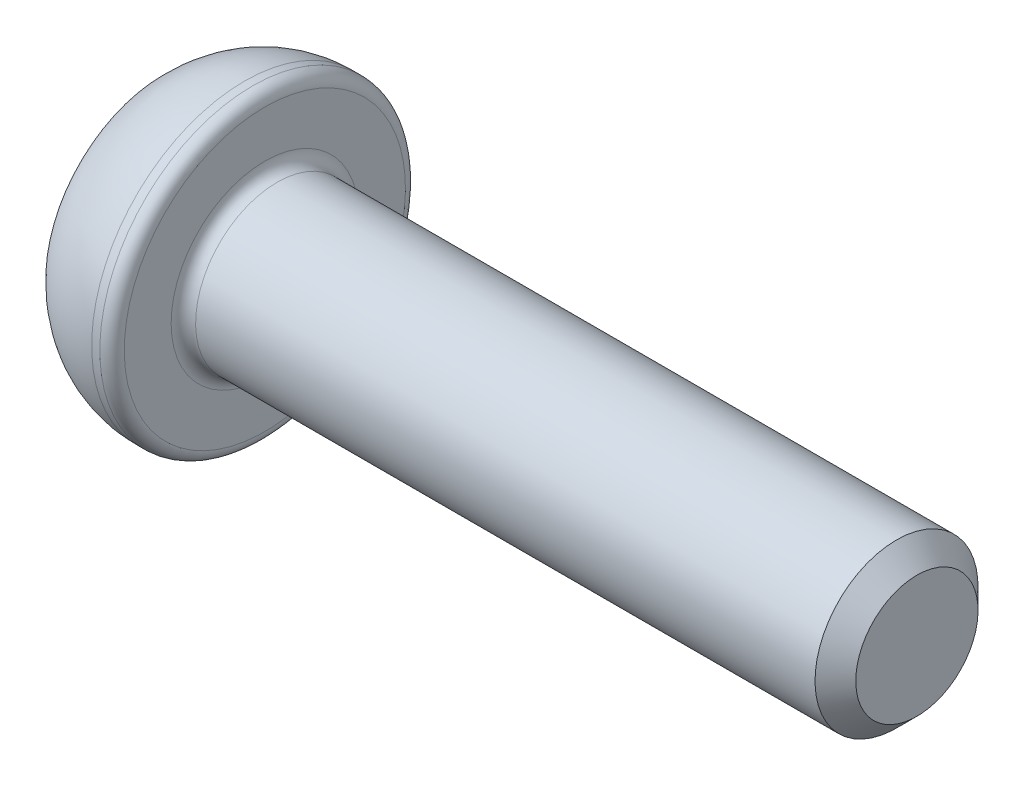
ISO-10303-21;
HEADER;
FILE_DESCRIPTION(('STEP AP214'),'2;1');
FILE_NAME('part.step','',(''),(''),'','','');
FILE_SCHEMA(('AUTOMOTIVE_DESIGN { 1 0 10303 214 1 1 1 1 }'));
ENDSEC;
DATA;
#1=APPLICATION_CONTEXT('core data for automotive mechanical design processes');
#2=APPLICATION_PROTOCOL_DEFINITION('international standard','automotive_design',2000,#1);
#3=PRODUCT_CONTEXT('',#1,'mechanical');
#4=PRODUCT('Part','Part','',(#3));
#5=PRODUCT_RELATED_PRODUCT_CATEGORY('part','',(#4));
#6=PRODUCT_DEFINITION_FORMATION('','',#4);
#7=PRODUCT_DEFINITION_CONTEXT('part definition',#1,'design');
#8=PRODUCT_DEFINITION('design','',#6,#7);
#9=PRODUCT_DEFINITION_SHAPE('','',#8);
#10=(LENGTH_UNIT() NAMED_UNIT(*) SI_UNIT(.MILLI.,.METRE.));
#11=(NAMED_UNIT(*) PLANE_ANGLE_UNIT() SI_UNIT($,.RADIAN.));
#12=(NAMED_UNIT(*) SI_UNIT($,.STERADIAN.) SOLID_ANGLE_UNIT());
#13=UNCERTAINTY_MEASURE_WITH_UNIT(LENGTH_MEASURE(1.E-05),#10,'distance_accuracy_value','');
#14=(GEOMETRIC_REPRESENTATION_CONTEXT(3) GLOBAL_UNCERTAINTY_ASSIGNED_CONTEXT((#13)) GLOBAL_UNIT_ASSIGNED_CONTEXT((#10,
#11,#12)) REPRESENTATION_CONTEXT('',''));
#15=CARTESIAN_POINT('',(0.,0.,0.));
#16=DIRECTION('',(0.,0.,1.));
#17=DIRECTION('',(1.,0.,0.));
#18=AXIS2_PLACEMENT_3D('',#15,#16,#17);
#19=CARTESIAN_POINT('',(0.,0.,0.));
#20=DIRECTION('',(-1.,0.,0.));
#21=DIRECTION('',(0.,-1.,0.));
#22=AXIS2_PLACEMENT_3D('',#19,#20,#21);
#23=PLANE('',#22);
#24=DIRECTION('',(0.,0.866025403784438,-0.5));
#25=VECTOR('',#24,1.);
#26=CARTESIAN_POINT('',(0.,0.,1.44337567297407));
#27=LINE('',#26,#25);
#28=CARTESIAN_POINT('',(0.,0.,1.44337567297407));
#29=VERTEX_POINT('',#28);
#30=CARTESIAN_POINT('',(0.,1.25,0.721687836487032));
#31=VERTEX_POINT('',#30);
#32=EDGE_CURVE('E55',#29,#31,#27,.T.);
#33=ORIENTED_EDGE('',*,*,#32,.F.);
#34=DIRECTION('',(0.,0.866025403784438,0.5));
#35=VECTOR('',#34,1.);
#36=CARTESIAN_POINT('',(0.,-1.25,0.721687836487033));
#37=LINE('',#36,#35);
#38=CARTESIAN_POINT('',(0.,-1.25,0.721687836487033));
#39=VERTEX_POINT('',#38);
#40=EDGE_CURVE('E138',#39,#29,#37,.T.);
#41=ORIENTED_EDGE('',*,*,#40,.F.);
#42=DIRECTION('',(0.,0.,1.));
#43=VECTOR('',#42,1.);
#44=CARTESIAN_POINT('',(0.,-1.25,-0.721687836487032));
#45=LINE('',#44,#43);
#46=CARTESIAN_POINT('',(0.,-1.25,-0.721687836487032));
#47=VERTEX_POINT('',#46);
#48=EDGE_CURVE('E136',#47,#39,#45,.T.);
#49=ORIENTED_EDGE('',*,*,#48,.F.);
#50=DIRECTION('',(0.,-0.866025403784438,0.5));
#51=VECTOR('',#50,1.);
#52=CARTESIAN_POINT('',(0.,0.,-1.44337567297407));
#53=LINE('',#52,#51);
#54=CARTESIAN_POINT('',(0.,0.,-1.44337567297407));
#55=VERTEX_POINT('',#54);
#56=EDGE_CURVE('E103',#55,#47,#53,.T.);
#57=ORIENTED_EDGE('',*,*,#56,.F.);
#58=DIRECTION('',(0.,-0.866025403784438,-0.5));
#59=VECTOR('',#58,1.);
#60=CARTESIAN_POINT('',(0.,1.25,-0.721687836487032));
#61=LINE('',#60,#59);
#62=CARTESIAN_POINT('',(0.,1.25,-0.721687836487032));
#63=VERTEX_POINT('',#62);
#64=EDGE_CURVE('E132',#63,#55,#61,.T.);
#65=ORIENTED_EDGE('',*,*,#64,.F.);
#66=DIRECTION('',(0.,0.,-1.));
#67=VECTOR('',#66,1.);
#68=CARTESIAN_POINT('',(0.,1.25,0.721687836487032));
#69=LINE('',#68,#67);
#70=EDGE_CURVE('E129',#31,#63,#69,.T.);
#71=ORIENTED_EDGE('',*,*,#70,.F.);
#72=EDGE_LOOP('',(#33,#41,#49,#57,#65,#71));
#73=FACE_BOUND('',#72,.T.);
#74=CARTESIAN_POINT('',(0.,0.,0.));
#75=DIRECTION('',(1.,0.,0.));
#76=DIRECTION('',(0.,1.,0.));
#77=AXIS2_PLACEMENT_3D('',#74,#75,#76);
#78=CIRCLE('',#77,2.875);
#79=CARTESIAN_POINT('',(0.,2.875,0.));
#80=VERTEX_POINT('',#79);
#81=EDGE_CURVE('E150',#80,#80,#78,.T.);
#82=ORIENTED_EDGE('',*,*,#81,.F.);
#83=EDGE_LOOP('',(#82));
#84=FACE_BOUND('',#83,.T.);
#85=ADVANCED_FACE('F39',(#73,#84),#23,.T.);
#86=CARTESIAN_POINT('',(2.,0.,0.));
#87=DIRECTION('',(1.,0.,0.));
#88=DIRECTION('',(0.,1.,0.));
#89=AXIS2_PLACEMENT_3D('',#86,#87,#88);
#90=DEGENERATE_TOROIDAL_SURFACE('',#89,1.02678571428571,2.72321428571429,.T.);
#91=ORIENTED_EDGE('',*,*,#81,.T.);
#92=EDGE_LOOP('',(#91));
#93=FACE_BOUND('',#92,.T.);
#94=CARTESIAN_POINT('',(2.,0.,0.));
#95=DIRECTION('',(1.,0.,0.));
#96=DIRECTION('',(0.,1.,0.));
#97=AXIS2_PLACEMENT_3D('',#94,#95,#96);
#98=CIRCLE('',#97,3.75);
#99=CARTESIAN_POINT('',(2.,3.75,0.));
#100=VERTEX_POINT('',#99);
#101=EDGE_CURVE('E142',#100,#100,#98,.T.);
#102=ORIENTED_EDGE('',*,*,#101,.F.);
#103=EDGE_LOOP('',(#102));
#104=FACE_BOUND('',#103,.T.);
#105=ADVANCED_FACE('F179',(#93,#104),#90,.T.);
#106=CARTESIAN_POINT('',(18.5,0.,0.));
#107=DIRECTION('',(1.,0.,0.));
#108=DIRECTION('',(0.,1.,0.));
#109=AXIS2_PLACEMENT_3D('',#106,#107,#108);
#110=CYLINDRICAL_SURFACE('',#109,3.75);
#111=CARTESIAN_POINT('',(2.2,0.,0.));
#112=DIRECTION('',(1.,0.,0.));
#113=DIRECTION('',(0.,1.,0.));
#114=AXIS2_PLACEMENT_3D('',#111,#112,#113);
#115=CIRCLE('',#114,3.75);
#116=CARTESIAN_POINT('',(2.2,3.75,0.));
#117=VERTEX_POINT('',#116);
#118=EDGE_CURVE('E162',#117,#117,#115,.F.);
#119=ORIENTED_EDGE('',*,*,#118,.T.);
#120=EDGE_LOOP('',(#119));
#121=FACE_BOUND('',#120,.T.);
#122=ORIENTED_EDGE('',*,*,#101,.T.);
#123=EDGE_LOOP('',(#122));
#124=FACE_BOUND('',#123,.T.);
#125=ADVANCED_FACE('F185',(#121,#124),#110,.T.);
#126=CARTESIAN_POINT('',(2.5,3.75,0.));
#127=DIRECTION('',(1.,0.,0.));
#128=DIRECTION('',(0.,1.,0.));
#129=AXIS2_PLACEMENT_3D('',#126,#127,#128);
#130=PLANE('',#129);
#131=CARTESIAN_POINT('',(2.5,0.,0.));
#132=DIRECTION('',(1.,0.,0.));
#133=DIRECTION('',(0.,1.,0.));
#134=AXIS2_PLACEMENT_3D('',#131,#132,#133);
#135=CIRCLE('',#134,2.3);
#136=CARTESIAN_POINT('',(2.5,2.3,0.));
#137=VERTEX_POINT('',#136);
#138=EDGE_CURVE('E159',#137,#137,#135,.F.);
#139=ORIENTED_EDGE('',*,*,#138,.T.);
#140=EDGE_LOOP('',(#139));
#141=FACE_BOUND('',#140,.T.);
#142=CARTESIAN_POINT('',(2.5,0.,0.));
#143=DIRECTION('',(1.,0.,0.));
#144=DIRECTION('',(0.,1.,0.));
#145=AXIS2_PLACEMENT_3D('',#142,#143,#144);
#146=CIRCLE('',#145,3.45);
#147=CARTESIAN_POINT('',(2.5,3.45,0.));
#148=VERTEX_POINT('',#147);
#149=EDGE_CURVE('E156',#148,#148,#146,.T.);
#150=ORIENTED_EDGE('',*,*,#149,.T.);
#151=EDGE_LOOP('',(#150));
#152=FACE_BOUND('',#151,.T.);
#153=ADVANCED_FACE('F204',(#141,#152),#130,.T.);
#154=CARTESIAN_POINT('',(18.5,0.,0.));
#155=DIRECTION('',(1.,0.,0.));
#156=DIRECTION('',(0.,1.,0.));
#157=AXIS2_PLACEMENT_3D('',#154,#155,#156);
#158=CYLINDRICAL_SURFACE('',#157,2.);
#159=CARTESIAN_POINT('',(18.,0.,0.));
#160=DIRECTION('',(1.,0.,0.));
#161=DIRECTION('',(0.,1.,0.));
#162=AXIS2_PLACEMENT_3D('',#159,#160,#161);
#163=CIRCLE('',#162,2.);
#164=CARTESIAN_POINT('',(18.,2.,0.));
#165=VERTEX_POINT('',#164);
#166=EDGE_CURVE('E11',#165,#165,#163,.F.);
#167=ORIENTED_EDGE('',*,*,#166,.T.);
#168=EDGE_LOOP('',(#167));
#169=FACE_BOUND('',#168,.T.);
#170=CARTESIAN_POINT('',(2.8,0.,0.));
#171=DIRECTION('',(1.,0.,0.));
#172=DIRECTION('',(0.,1.,0.));
#173=AXIS2_PLACEMENT_3D('',#170,#171,#172);
#174=CIRCLE('',#173,2.);
#175=CARTESIAN_POINT('',(2.8,2.,0.));
#176=VERTEX_POINT('',#175);
#177=EDGE_CURVE('E153',#176,#176,#174,.T.);
#178=ORIENTED_EDGE('',*,*,#177,.T.);
#179=EDGE_LOOP('',(#178));
#180=FACE_BOUND('',#179,.T.);
#181=ADVANCED_FACE('F202',(#169,#180),#158,.T.);
#182=CARTESIAN_POINT('',(18.5,2.,0.));
#183=DIRECTION('',(1.,0.,0.));
#184=DIRECTION('',(0.,1.,0.));
#185=AXIS2_PLACEMENT_3D('',#182,#183,#184);
#186=PLANE('',#185);
#187=CARTESIAN_POINT('',(18.5,0.,0.));
#188=DIRECTION('',(1.,0.,0.));
#189=DIRECTION('',(0.,1.,0.));
#190=AXIS2_PLACEMENT_3D('',#187,#188,#189);
#191=CIRCLE('',#190,1.5);
#192=CARTESIAN_POINT('',(18.5,1.5,0.));
#193=VERTEX_POINT('',#192);
#194=EDGE_CURVE('E48',#193,#193,#191,.T.);
#195=ORIENTED_EDGE('',*,*,#194,.T.);
#196=EDGE_LOOP('',(#195));
#197=FACE_BOUND('',#196,.T.);
#198=ADVANCED_FACE('F167',(#197),#186,.T.);
#199=CARTESIAN_POINT('',(1.5,0.,1.44337567297407));
#200=DIRECTION('',(0.,0.5,0.866025403784438));
#201=DIRECTION('',(0.,-0.866025403784439,0.5));
#202=AXIS2_PLACEMENT_3D('',#199,#200,#201);
#203=PLANE('',#202);
#204=ORIENTED_EDGE('',*,*,#32,.T.);
#205=DIRECTION('',(-1.,0.,0.));
#206=VECTOR('',#205,1.);
#207=CARTESIAN_POINT('',(1.5,1.25,0.721687836487032));
#208=LINE('',#207,#206);
#209=CARTESIAN_POINT('',(1.5,1.25,0.721687836487032));
#210=VERTEX_POINT('',#209);
#211=EDGE_CURVE('E85',#210,#31,#208,.T.);
#212=ORIENTED_EDGE('',*,*,#211,.F.);
#213=DIRECTION('',(0.,0.866025403784438,-0.5));
#214=VECTOR('',#213,1.);
#215=CARTESIAN_POINT('',(1.5,0.,1.44337567297407));
#216=LINE('',#215,#214);
#217=CARTESIAN_POINT('',(1.5,0.,1.44337567297407));
#218=VERTEX_POINT('',#217);
#219=EDGE_CURVE('E140',#218,#210,#216,.T.);
#220=ORIENTED_EDGE('',*,*,#219,.F.);
#221=DIRECTION('',(-1.,0.,0.));
#222=VECTOR('',#221,1.);
#223=CARTESIAN_POINT('',(1.5,0.,1.44337567297407));
#224=LINE('',#223,#222);
#225=EDGE_CURVE('E63',#218,#29,#224,.T.);
#226=ORIENTED_EDGE('',*,*,#225,.T.);
#227=EDGE_LOOP('',(#204,#212,#220,#226));
#228=FACE_BOUND('',#227,.T.);
#229=ADVANCED_FACE('F211',(#228),#203,.F.);
#230=CARTESIAN_POINT('',(1.5,-1.25,0.721687836487033));
#231=DIRECTION('',(0.,-0.5,0.866025403784439));
#232=DIRECTION('',(0.,-0.866025403784439,-0.5));
#233=AXIS2_PLACEMENT_3D('',#230,#231,#232);
#234=PLANE('',#233);
#235=ORIENTED_EDGE('',*,*,#40,.T.);
#236=ORIENTED_EDGE('',*,*,#225,.F.);
#237=DIRECTION('',(0.,0.866025403784438,0.5));
#238=VECTOR('',#237,1.);
#239=CARTESIAN_POINT('',(1.5,-1.25,0.721687836487033));
#240=LINE('',#239,#238);
#241=CARTESIAN_POINT('',(1.5,-1.25,0.721687836487033));
#242=VERTEX_POINT('',#241);
#243=EDGE_CURVE('E115',#242,#218,#240,.T.);
#244=ORIENTED_EDGE('',*,*,#243,.F.);
#245=DIRECTION('',(-1.,0.,0.));
#246=VECTOR('',#245,1.);
#247=CARTESIAN_POINT('',(1.5,-1.25,0.721687836487033));
#248=LINE('',#247,#246);
#249=EDGE_CURVE('E107',#242,#39,#248,.T.);
#250=ORIENTED_EDGE('',*,*,#249,.T.);
#251=EDGE_LOOP('',(#235,#236,#244,#250));
#252=FACE_BOUND('',#251,.T.);
#253=ADVANCED_FACE('F270',(#252),#234,.F.);
#254=CARTESIAN_POINT('',(1.5,-1.25,-0.721687836487032));
#255=DIRECTION('',(0.,-1.,0.));
#256=DIRECTION('',(0.,0.,-1.));
#257=AXIS2_PLACEMENT_3D('',#254,#255,#256);
#258=PLANE('',#257);
#259=ORIENTED_EDGE('',*,*,#48,.T.);
#260=ORIENTED_EDGE('',*,*,#249,.F.);
#261=DIRECTION('',(0.,0.,1.));
#262=VECTOR('',#261,1.);
#263=CARTESIAN_POINT('',(1.5,-1.25,-0.721687836487032));
#264=LINE('',#263,#262);
#265=CARTESIAN_POINT('',(1.5,-1.25,-0.721687836487032));
#266=VERTEX_POINT('',#265);
#267=EDGE_CURVE('E111',#266,#242,#264,.T.);
#268=ORIENTED_EDGE('',*,*,#267,.F.);
#269=DIRECTION('',(-1.,0.,0.));
#270=VECTOR('',#269,1.);
#271=CARTESIAN_POINT('',(1.5,-1.25,-0.721687836487032));
#272=LINE('',#271,#270);
#273=EDGE_CURVE('E96',#266,#47,#272,.T.);
#274=ORIENTED_EDGE('',*,*,#273,.T.);
#275=EDGE_LOOP('',(#259,#260,#268,#274));
#276=FACE_BOUND('',#275,.T.);
#277=ADVANCED_FACE('F112',(#276),#258,.F.);
#278=CARTESIAN_POINT('',(1.5,0.,-1.44337567297407));
#279=DIRECTION('',(0.,-0.5,-0.866025403784439));
#280=DIRECTION('',(0.,0.866025403784439,-0.5));
#281=AXIS2_PLACEMENT_3D('',#278,#279,#280);
#282=PLANE('',#281);
#283=ORIENTED_EDGE('',*,*,#56,.T.);
#284=ORIENTED_EDGE('',*,*,#273,.F.);
#285=DIRECTION('',(0.,-0.866025403784438,0.5));
#286=VECTOR('',#285,1.);
#287=CARTESIAN_POINT('',(1.5,0.,-1.44337567297407));
#288=LINE('',#287,#286);
#289=CARTESIAN_POINT('',(1.5,0.,-1.44337567297407));
#290=VERTEX_POINT('',#289);
#291=EDGE_CURVE('E100',#290,#266,#288,.T.);
#292=ORIENTED_EDGE('',*,*,#291,.F.);
#293=DIRECTION('',(-1.,0.,0.));
#294=VECTOR('',#293,1.);
#295=CARTESIAN_POINT('',(1.5,0.,-1.44337567297407));
#296=LINE('',#295,#294);
#297=EDGE_CURVE('E108',#290,#55,#296,.T.);
#298=ORIENTED_EDGE('',*,*,#297,.T.);
#299=EDGE_LOOP('',(#283,#284,#292,#298));
#300=FACE_BOUND('',#299,.T.);
#301=ADVANCED_FACE('F98',(#300),#282,.F.);
#302=CARTESIAN_POINT('',(1.5,1.25,-0.721687836487032));
#303=DIRECTION('',(0.,0.5,-0.866025403784438));
#304=DIRECTION('',(0.,0.866025403784439,0.5));
#305=AXIS2_PLACEMENT_3D('',#302,#303,#304);
#306=PLANE('',#305);
#307=ORIENTED_EDGE('',*,*,#64,.T.);
#308=ORIENTED_EDGE('',*,*,#297,.F.);
#309=DIRECTION('',(0.,-0.866025403784438,-0.5));
#310=VECTOR('',#309,1.);
#311=CARTESIAN_POINT('',(1.5,1.25,-0.721687836487032));
#312=LINE('',#311,#310);
#313=CARTESIAN_POINT('',(1.5,1.25,-0.721687836487032));
#314=VERTEX_POINT('',#313);
#315=EDGE_CURVE('E121',#314,#290,#312,.T.);
#316=ORIENTED_EDGE('',*,*,#315,.F.);
#317=DIRECTION('',(-1.,0.,0.));
#318=VECTOR('',#317,1.);
#319=CARTESIAN_POINT('',(1.5,1.25,-0.721687836487032));
#320=LINE('',#319,#318);
#321=EDGE_CURVE('E145',#314,#63,#320,.T.);
#322=ORIENTED_EDGE('',*,*,#321,.T.);
#323=EDGE_LOOP('',(#307,#308,#316,#322));
#324=FACE_BOUND('',#323,.T.);
#325=ADVANCED_FACE('F287',(#324),#306,.F.);
#326=CARTESIAN_POINT('',(1.5,1.25,0.721687836487032));
#327=DIRECTION('',(0.,1.,0.));
#328=DIRECTION('',(0.,0.,1.));
#329=AXIS2_PLACEMENT_3D('',#326,#327,#328);
#330=PLANE('',#329);
#331=ORIENTED_EDGE('',*,*,#70,.T.);
#332=ORIENTED_EDGE('',*,*,#321,.F.);
#333=DIRECTION('',(0.,0.,-1.));
#334=VECTOR('',#333,1.);
#335=CARTESIAN_POINT('',(1.5,1.25,0.721687836487032));
#336=LINE('',#335,#334);
#337=EDGE_CURVE('E123',#210,#314,#336,.T.);
#338=ORIENTED_EDGE('',*,*,#337,.F.);
#339=ORIENTED_EDGE('',*,*,#211,.T.);
#340=EDGE_LOOP('',(#331,#332,#338,#339));
#341=FACE_BOUND('',#340,.T.);
#342=ADVANCED_FACE('F196',(#341),#330,.F.);
#343=CARTESIAN_POINT('',(1.5,0.,0.));
#344=DIRECTION('',(-1.,0.,0.));
#345=DIRECTION('',(0.,0.,1.));
#346=AXIS2_PLACEMENT_3D('',#343,#344,#345);
#347=PLANE('',#346);
#348=ORIENTED_EDGE('',*,*,#219,.T.);
#349=ORIENTED_EDGE('',*,*,#337,.T.);
#350=ORIENTED_EDGE('',*,*,#315,.T.);
#351=ORIENTED_EDGE('',*,*,#291,.T.);
#352=ORIENTED_EDGE('',*,*,#267,.T.);
#353=ORIENTED_EDGE('',*,*,#243,.T.);
#354=EDGE_LOOP('',(#348,#349,#350,#351,#352,#353));
#355=FACE_BOUND('',#354,.T.);
#356=ADVANCED_FACE('F118',(#355),#347,.T.);
#357=CARTESIAN_POINT('',(2.8,0.,0.));
#358=DIRECTION('',(1.,0.,0.));
#359=DIRECTION('',(0.,1.,0.));
#360=AXIS2_PLACEMENT_3D('',#357,#358,#359);
#361=TOROIDAL_SURFACE('',#360,2.3,0.3);
#362=ORIENTED_EDGE('',*,*,#138,.F.);
#363=EDGE_LOOP('',(#362));
#364=FACE_BOUND('',#363,.T.);
#365=ORIENTED_EDGE('',*,*,#177,.F.);
#366=EDGE_LOOP('',(#365));
#367=FACE_BOUND('',#366,.T.);
#368=ADVANCED_FACE('F175',(#364,#367),#361,.F.);
#369=CARTESIAN_POINT('',(2.2,0.,0.));
#370=DIRECTION('',(1.,0.,0.));
#371=DIRECTION('',(0.,1.,0.));
#372=AXIS2_PLACEMENT_3D('',#369,#370,#371);
#373=TOROIDAL_SURFACE('',#372,3.45,0.3);
#374=ORIENTED_EDGE('',*,*,#118,.F.);
#375=EDGE_LOOP('',(#374));
#376=FACE_BOUND('',#375,.T.);
#377=ORIENTED_EDGE('',*,*,#149,.F.);
#378=EDGE_LOOP('',(#377));
#379=FACE_BOUND('',#378,.T.);
#380=ADVANCED_FACE('F170',(#376,#379),#373,.T.);
#381=CARTESIAN_POINT('',(18.5,0.,0.));
#382=DIRECTION('',(-1.,0.,0.));
#383=DIRECTION('',(0.,-1.,0.));
#384=AXIS2_PLACEMENT_3D('',#381,#382,#383);
#385=CONICAL_SURFACE('',#384,1.5,0.785398163397444);
#386=ORIENTED_EDGE('',*,*,#166,.F.);
#387=EDGE_LOOP('',(#386));
#388=FACE_BOUND('',#387,.T.);
#389=ORIENTED_EDGE('',*,*,#194,.F.);
#390=EDGE_LOOP('',(#389));
#391=FACE_BOUND('',#390,.T.);
#392=ADVANCED_FACE('F42',(#388,#391),#385,.T.);
#393=CLOSED_SHELL('',(#85,#105,#125,#153,#181,#198,#229,#253,#277,#301,#325,#342,#356,#368,#380,#392));
#394=MANIFOLD_SOLID_BREP('B2',#393);
#395=ADVANCED_BREP_SHAPE_REPRESENTATION('',(#18,#394),#14);
#396=SHAPE_DEFINITION_REPRESENTATION(#9,#395);
ENDSEC;
END-ISO-10303-21;
